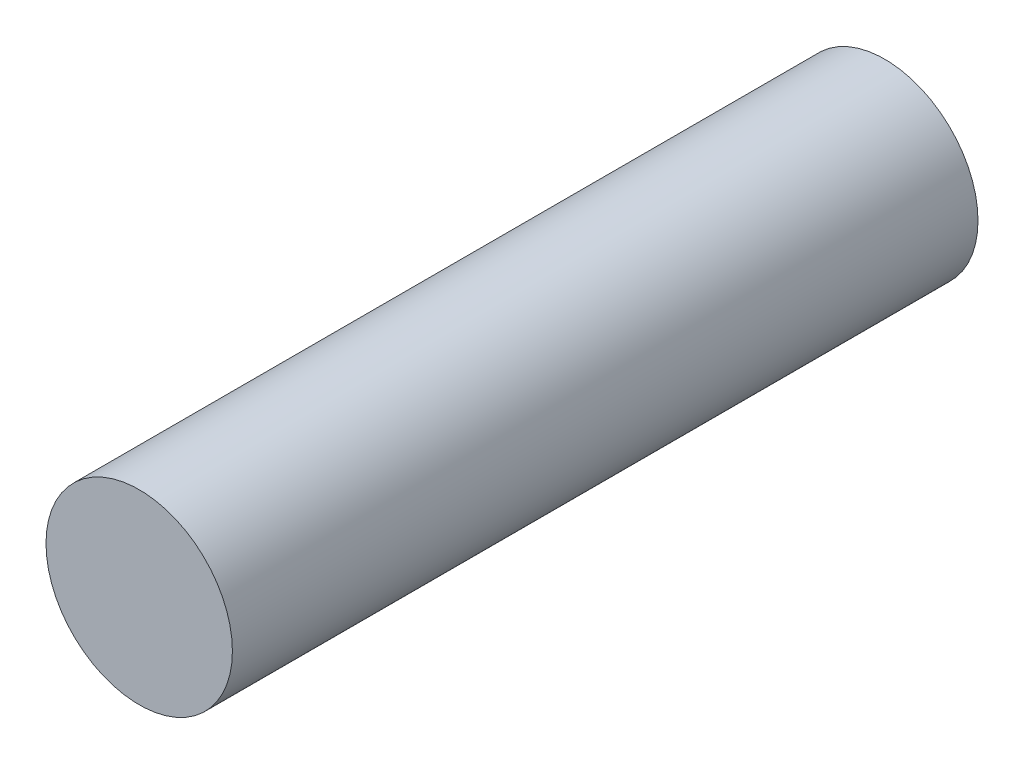
ISO-10303-21;
HEADER;
FILE_DESCRIPTION(('STEP AP214'),'2;1');
FILE_NAME('part.step','',(''),(''),'','','');
FILE_SCHEMA(('AUTOMOTIVE_DESIGN { 1 0 10303 214 1 1 1 1 }'));
ENDSEC;
DATA;
#1=APPLICATION_CONTEXT('core data for automotive mechanical design processes');
#2=APPLICATION_PROTOCOL_DEFINITION('international standard','automotive_design',2000,#1);
#3=PRODUCT_CONTEXT('',#1,'mechanical');
#4=PRODUCT('Part','Part','',(#3));
#5=PRODUCT_RELATED_PRODUCT_CATEGORY('part','',(#4));
#6=PRODUCT_DEFINITION_FORMATION('','',#4);
#7=PRODUCT_DEFINITION_CONTEXT('part definition',#1,'design');
#8=PRODUCT_DEFINITION('design','',#6,#7);
#9=PRODUCT_DEFINITION_SHAPE('','',#8);
#10=(LENGTH_UNIT() NAMED_UNIT(*) SI_UNIT(.MILLI.,.METRE.));
#11=(NAMED_UNIT(*) PLANE_ANGLE_UNIT() SI_UNIT($,.RADIAN.));
#12=(NAMED_UNIT(*) SI_UNIT($,.STERADIAN.) SOLID_ANGLE_UNIT());
#13=UNCERTAINTY_MEASURE_WITH_UNIT(LENGTH_MEASURE(1.E-05),#10,'distance_accuracy_value','');
#14=(GEOMETRIC_REPRESENTATION_CONTEXT(3) GLOBAL_UNCERTAINTY_ASSIGNED_CONTEXT((#13)) GLOBAL_UNIT_ASSIGNED_CONTEXT((#10,
#11,#12)) REPRESENTATION_CONTEXT('',''));
#15=CARTESIAN_POINT('',(0.,0.,0.));
#16=DIRECTION('',(0.,0.,1.));
#17=DIRECTION('',(1.,0.,0.));
#18=AXIS2_PLACEMENT_3D('',#15,#16,#17);
#19=CARTESIAN_POINT('',(0.,0.,38.1));
#20=DIRECTION('',(0.,0.,-1.));
#21=DIRECTION('',(-1.,0.,0.));
#22=AXIS2_PLACEMENT_3D('',#19,#20,#21);
#23=CYLINDRICAL_SURFACE('',#22,4.7625);
#24=CARTESIAN_POINT('',(0.,0.,38.1));
#25=DIRECTION('',(0.,0.,1.));
#26=DIRECTION('',(1.,0.,0.));
#27=AXIS2_PLACEMENT_3D('',#24,#25,#26);
#28=CIRCLE('',#27,4.7625);
#29=CARTESIAN_POINT('',(4.7625,0.,38.1));
#30=VERTEX_POINT('',#29);
#31=EDGE_CURVE('E10',#30,#30,#28,.T.);
#32=ORIENTED_EDGE('',*,*,#31,.F.);
#33=EDGE_LOOP('',(#32));
#34=FACE_BOUND('',#33,.T.);
#35=CARTESIAN_POINT('',(0.,0.,0.));
#36=DIRECTION('',(0.,0.,1.));
#37=DIRECTION('',(1.,0.,0.));
#38=AXIS2_PLACEMENT_3D('',#35,#36,#37);
#39=CIRCLE('',#38,4.7625);
#40=CARTESIAN_POINT('',(4.7625,0.,0.));
#41=VERTEX_POINT('',#40);
#42=EDGE_CURVE('E33',#41,#41,#39,.T.);
#43=ORIENTED_EDGE('',*,*,#42,.T.);
#44=EDGE_LOOP('',(#43));
#45=FACE_BOUND('',#44,.T.);
#46=ADVANCED_FACE('F30',(#34,#45),#23,.T.);
#47=CARTESIAN_POINT('',(0.,0.,38.1));
#48=DIRECTION('',(0.,0.,1.));
#49=DIRECTION('',(1.,0.,0.));
#50=AXIS2_PLACEMENT_3D('',#47,#48,#49);
#51=PLANE('',#50);
#52=ORIENTED_EDGE('',*,*,#31,.T.);
#53=EDGE_LOOP('',(#52));
#54=FACE_BOUND('',#53,.T.);
#55=ADVANCED_FACE('F45',(#54),#51,.T.);
#56=CARTESIAN_POINT('',(0.,0.,0.));
#57=DIRECTION('',(0.,0.,1.));
#58=DIRECTION('',(1.,0.,0.));
#59=AXIS2_PLACEMENT_3D('',#56,#57,#58);
#60=PLANE('',#59);
#61=ORIENTED_EDGE('',*,*,#42,.F.);
#62=EDGE_LOOP('',(#61));
#63=FACE_BOUND('',#62,.T.);
#64=ADVANCED_FACE('F43',(#63),#60,.F.);
#65=CLOSED_SHELL('',(#46,#55,#64));
#66=MANIFOLD_SOLID_BREP('B2',#65);
#67=ADVANCED_BREP_SHAPE_REPRESENTATION('',(#18,#66),#14);
#68=SHAPE_DEFINITION_REPRESENTATION(#9,#67);
ENDSEC;
END-ISO-10303-21;
